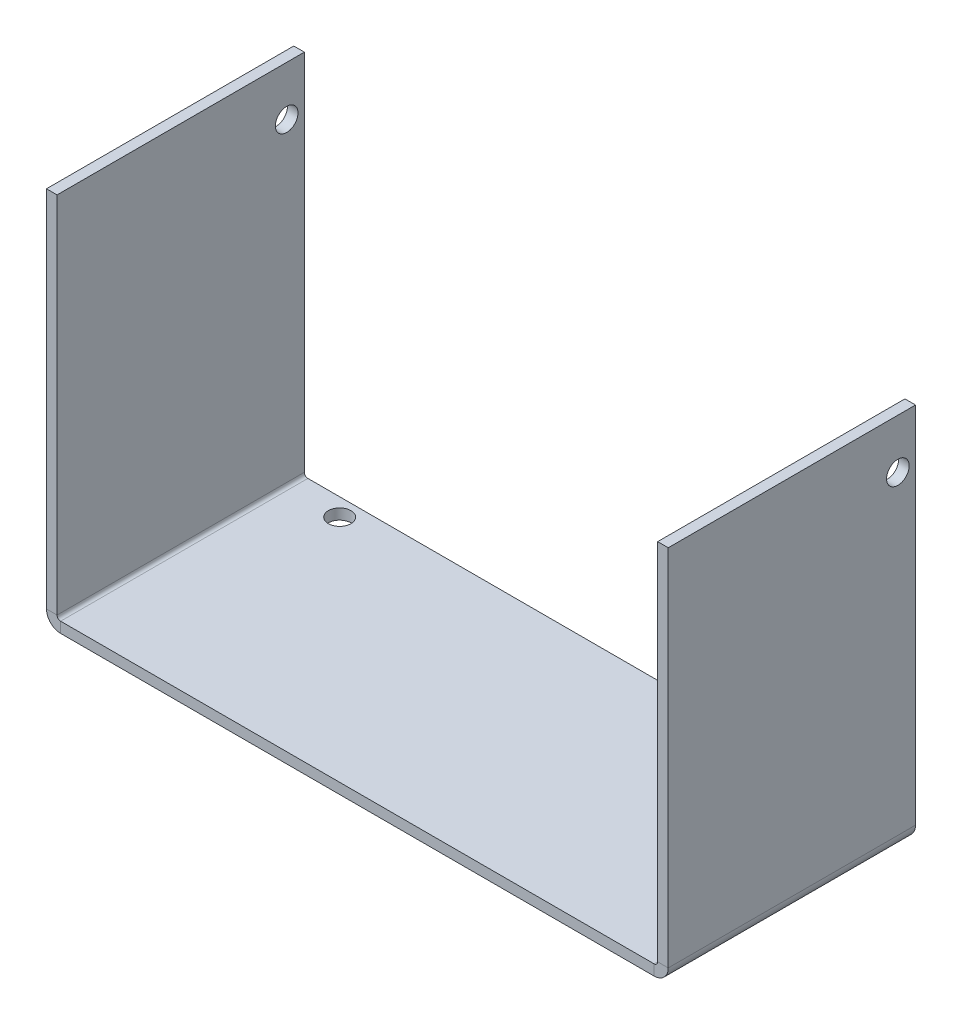
ISO-10303-21;
HEADER;
FILE_DESCRIPTION(('STEP AP214'),'2;1');
FILE_NAME('part.step','',(''),(''),'','','');
FILE_SCHEMA(('AUTOMOTIVE_DESIGN { 1 0 10303 214 1 1 1 1 }'));
ENDSEC;
DATA;
#1=APPLICATION_CONTEXT('core data for automotive mechanical design processes');
#2=APPLICATION_PROTOCOL_DEFINITION('international standard','automotive_design',2000,#1);
#3=PRODUCT_CONTEXT('',#1,'mechanical');
#4=PRODUCT('Part','Part','',(#3));
#5=PRODUCT_RELATED_PRODUCT_CATEGORY('part','',(#4));
#6=PRODUCT_DEFINITION_FORMATION('','',#4);
#7=PRODUCT_DEFINITION_CONTEXT('part definition',#1,'design');
#8=PRODUCT_DEFINITION('design','',#6,#7);
#9=PRODUCT_DEFINITION_SHAPE('','',#8);
#10=(LENGTH_UNIT() NAMED_UNIT(*) SI_UNIT(.MILLI.,.METRE.));
#11=(NAMED_UNIT(*) PLANE_ANGLE_UNIT() SI_UNIT($,.RADIAN.));
#12=(NAMED_UNIT(*) SI_UNIT($,.STERADIAN.) SOLID_ANGLE_UNIT());
#13=UNCERTAINTY_MEASURE_WITH_UNIT(LENGTH_MEASURE(1.E-05),#10,'distance_accuracy_value','');
#14=(GEOMETRIC_REPRESENTATION_CONTEXT(3) GLOBAL_UNCERTAINTY_ASSIGNED_CONTEXT((#13)) GLOBAL_UNIT_ASSIGNED_CONTEXT((#10,
#11,#12)) REPRESENTATION_CONTEXT('',''));
#15=CARTESIAN_POINT('',(0.,0.,0.));
#16=DIRECTION('',(0.,0.,1.));
#17=DIRECTION('',(1.,0.,0.));
#18=AXIS2_PLACEMENT_3D('',#15,#16,#17);
#19=CARTESIAN_POINT('',(-42.,2.,35.));
#20=DIRECTION('',(0.,0.,-1.));
#21=DIRECTION('',(-1.,0.,0.));
#22=AXIS2_PLACEMENT_3D('',#19,#20,#21);
#23=PLANE('',#22);
#24=DIRECTION('',(0.,-1.,0.));
#25=VECTOR('',#24,1.);
#26=CARTESIAN_POINT('',(-42.,0.,35.));
#27=LINE('',#26,#25);
#28=CARTESIAN_POINT('',(-42.,1.5,35.));
#29=VERTEX_POINT('',#28);
#30=CARTESIAN_POINT('',(-42.,0.,35.));
#31=VERTEX_POINT('',#30);
#32=EDGE_CURVE('E11',#29,#31,#27,.T.);
#33=ORIENTED_EDGE('',*,*,#32,.F.);
#34=CARTESIAN_POINT('',(-42.,2.,35.));
#35=DIRECTION('',(0.,0.,-1.));
#36=DIRECTION('',(-1.,0.,0.));
#37=AXIS2_PLACEMENT_3D('',#34,#35,#36);
#38=CIRCLE('',#37,0.5);
#39=CARTESIAN_POINT('',(-42.5,2.,35.));
#40=VERTEX_POINT('',#39);
#41=EDGE_CURVE('E104',#40,#29,#38,.F.);
#42=ORIENTED_EDGE('',*,*,#41,.F.);
#43=DIRECTION('',(-1.,0.,0.));
#44=VECTOR('',#43,1.);
#45=CARTESIAN_POINT('',(-44.,2.,35.));
#46=LINE('',#45,#44);
#47=CARTESIAN_POINT('',(-44.,2.,35.));
#48=VERTEX_POINT('',#47);
#49=EDGE_CURVE('E52',#40,#48,#46,.T.);
#50=ORIENTED_EDGE('',*,*,#49,.T.);
#51=CARTESIAN_POINT('',(-42.,2.,35.));
#52=DIRECTION('',(0.,0.,1.));
#53=DIRECTION('',(1.,0.,0.));
#54=AXIS2_PLACEMENT_3D('',#51,#52,#53);
#55=CIRCLE('',#54,2.);
#56=EDGE_CURVE('E107',#48,#31,#55,.T.);
#57=ORIENTED_EDGE('',*,*,#56,.T.);
#58=EDGE_LOOP('',(#33,#42,#50,#57));
#59=FACE_BOUND('',#58,.T.);
#60=ADVANCED_FACE('F42',(#59),#23,.F.);
#61=CARTESIAN_POINT('',(-44.,53.5,35.));
#62=DIRECTION('',(0.,0.,1.));
#63=DIRECTION('',(0.,-1.,0.));
#64=AXIS2_PLACEMENT_3D('',#61,#62,#63);
#65=PLANE('',#64);
#66=ORIENTED_EDGE('',*,*,#49,.F.);
#67=DIRECTION('',(0.,1.,0.));
#68=VECTOR('',#67,1.);
#69=CARTESIAN_POINT('',(-42.5,53.5,35.));
#70=LINE('',#69,#68);
#71=CARTESIAN_POINT('',(-42.5,53.5,35.));
#72=VERTEX_POINT('',#71);
#73=EDGE_CURVE('E259',#72,#40,#70,.F.);
#74=ORIENTED_EDGE('',*,*,#73,.F.);
#75=DIRECTION('',(-1.,0.,0.));
#76=VECTOR('',#75,1.);
#77=CARTESIAN_POINT('',(-44.,53.5,35.));
#78=LINE('',#77,#76);
#79=CARTESIAN_POINT('',(-44.,53.5,35.));
#80=VERTEX_POINT('',#79);
#81=EDGE_CURVE('E179',#72,#80,#78,.T.);
#82=ORIENTED_EDGE('',*,*,#81,.T.);
#83=DIRECTION('',(0.,-1.,0.));
#84=VECTOR('',#83,1.);
#85=CARTESIAN_POINT('',(-44.,53.5,35.));
#86=LINE('',#85,#84);
#87=EDGE_CURVE('E200',#80,#48,#86,.T.);
#88=ORIENTED_EDGE('',*,*,#87,.T.);
#89=EDGE_LOOP('',(#66,#74,#82,#88));
#90=FACE_BOUND('',#89,.T.);
#91=ADVANCED_FACE('F201',(#90),#65,.T.);
#92=CARTESIAN_POINT('',(-44.,53.5,35.));
#93=DIRECTION('',(0.,-1.,0.));
#94=DIRECTION('',(0.,0.,-1.));
#95=AXIS2_PLACEMENT_3D('',#92,#93,#94);
#96=PLANE('',#95);
#97=ORIENTED_EDGE('',*,*,#81,.F.);
#98=DIRECTION('',(0.,0.,1.));
#99=VECTOR('',#98,1.);
#100=CARTESIAN_POINT('',(-42.5,53.5,35.));
#101=LINE('',#100,#99);
#102=CARTESIAN_POINT('',(-42.5,53.5,0.));
#103=VERTEX_POINT('',#102);
#104=EDGE_CURVE('E152',#72,#103,#101,.F.);
#105=ORIENTED_EDGE('',*,*,#104,.T.);
#106=DIRECTION('',(-1.,0.,0.));
#107=VECTOR('',#106,1.);
#108=CARTESIAN_POINT('',(-44.,53.5,0.));
#109=LINE('',#108,#107);
#110=CARTESIAN_POINT('',(-44.,53.5,0.));
#111=VERTEX_POINT('',#110);
#112=EDGE_CURVE('E176',#103,#111,#109,.T.);
#113=ORIENTED_EDGE('',*,*,#112,.T.);
#114=DIRECTION('',(0.,0.,-1.));
#115=VECTOR('',#114,1.);
#116=CARTESIAN_POINT('',(-44.,53.5,35.));
#117=LINE('',#116,#115);
#118=EDGE_CURVE('E205',#80,#111,#117,.T.);
#119=ORIENTED_EDGE('',*,*,#118,.F.);
#120=EDGE_LOOP('',(#97,#105,#113,#119));
#121=FACE_BOUND('',#120,.T.);
#122=ADVANCED_FACE('F283',(#121),#96,.F.);
#123=CARTESIAN_POINT('',(-44.,53.5,0.));
#124=DIRECTION('',(0.,0.,1.));
#125=DIRECTION('',(0.,-1.,0.));
#126=AXIS2_PLACEMENT_3D('',#123,#124,#125);
#127=PLANE('',#126);
#128=ORIENTED_EDGE('',*,*,#112,.F.);
#129=DIRECTION('',(0.,1.,0.));
#130=VECTOR('',#129,1.);
#131=CARTESIAN_POINT('',(-42.5,53.5,0.));
#132=LINE('',#131,#130);
#133=CARTESIAN_POINT('',(-42.5,2.,0.));
#134=VERTEX_POINT('',#133);
#135=EDGE_CURVE('E157',#103,#134,#132,.F.);
#136=ORIENTED_EDGE('',*,*,#135,.T.);
#137=DIRECTION('',(-1.,0.,0.));
#138=VECTOR('',#137,1.);
#139=CARTESIAN_POINT('',(-44.,2.,0.));
#140=LINE('',#139,#138);
#141=CARTESIAN_POINT('',(-44.,2.,0.));
#142=VERTEX_POINT('',#141);
#143=EDGE_CURVE('E173',#134,#142,#140,.T.);
#144=ORIENTED_EDGE('',*,*,#143,.T.);
#145=DIRECTION('',(0.,-1.,0.));
#146=VECTOR('',#145,1.);
#147=CARTESIAN_POINT('',(-44.,53.5,0.));
#148=LINE('',#147,#146);
#149=EDGE_CURVE('E210',#111,#142,#148,.T.);
#150=ORIENTED_EDGE('',*,*,#149,.F.);
#151=EDGE_LOOP('',(#128,#136,#144,#150));
#152=FACE_BOUND('',#151,.T.);
#153=ADVANCED_FACE('F288',(#152),#127,.F.);
#154=CARTESIAN_POINT('',(-42.,2.,0.));
#155=DIRECTION('',(0.,0.,-1.));
#156=DIRECTION('',(-1.,0.,0.));
#157=AXIS2_PLACEMENT_3D('',#154,#155,#156);
#158=PLANE('',#157);
#159=ORIENTED_EDGE('',*,*,#143,.F.);
#160=CARTESIAN_POINT('',(-42.,2.,0.));
#161=DIRECTION('',(0.,0.,-1.));
#162=DIRECTION('',(-1.,0.,0.));
#163=AXIS2_PLACEMENT_3D('',#160,#161,#162);
#164=CIRCLE('',#163,0.5);
#165=CARTESIAN_POINT('',(-42.,1.5,0.));
#166=VERTEX_POINT('',#165);
#167=EDGE_CURVE('E133',#166,#134,#164,.T.);
#168=ORIENTED_EDGE('',*,*,#167,.F.);
#169=DIRECTION('',(0.,-1.,0.));
#170=VECTOR('',#169,1.);
#171=CARTESIAN_POINT('',(-42.,0.,0.));
#172=LINE('',#171,#170);
#173=CARTESIAN_POINT('',(-42.,0.,0.));
#174=VERTEX_POINT('',#173);
#175=EDGE_CURVE('E170',#166,#174,#172,.T.);
#176=ORIENTED_EDGE('',*,*,#175,.T.);
#177=CARTESIAN_POINT('',(-42.,2.,0.));
#178=DIRECTION('',(0.,0.,1.));
#179=DIRECTION('',(1.,0.,0.));
#180=AXIS2_PLACEMENT_3D('',#177,#178,#179);
#181=CIRCLE('',#180,2.);
#182=EDGE_CURVE('E196',#174,#142,#181,.F.);
#183=ORIENTED_EDGE('',*,*,#182,.T.);
#184=EDGE_LOOP('',(#159,#168,#176,#183));
#185=FACE_BOUND('',#184,.T.);
#186=ADVANCED_FACE('F291',(#185),#158,.T.);
#187=CARTESIAN_POINT('',(-44.,0.,0.));
#188=DIRECTION('',(0.,0.,1.));
#189=DIRECTION('',(1.,0.,0.));
#190=AXIS2_PLACEMENT_3D('',#187,#188,#189);
#191=PLANE('',#190);
#192=ORIENTED_EDGE('',*,*,#175,.F.);
#193=DIRECTION('',(-1.,0.,0.));
#194=VECTOR('',#193,1.);
#195=CARTESIAN_POINT('',(-44.,1.5,0.));
#196=LINE('',#195,#194);
#197=CARTESIAN_POINT('',(42.,1.50000000000002,0.));
#198=VERTEX_POINT('',#197);
#199=EDGE_CURVE('E123',#166,#198,#196,.F.);
#200=ORIENTED_EDGE('',*,*,#199,.T.);
#201=DIRECTION('',(0.,-1.,0.));
#202=VECTOR('',#201,1.);
#203=CARTESIAN_POINT('',(42.,0.,0.));
#204=LINE('',#203,#202);
#205=CARTESIAN_POINT('',(42.,0.,0.));
#206=VERTEX_POINT('',#205);
#207=EDGE_CURVE('E167',#198,#206,#204,.T.);
#208=ORIENTED_EDGE('',*,*,#207,.T.);
#209=DIRECTION('',(1.,0.,0.));
#210=VECTOR('',#209,1.);
#211=CARTESIAN_POINT('',(-44.,0.,0.));
#212=LINE('',#211,#210);
#213=EDGE_CURVE('E227',#174,#206,#212,.T.);
#214=ORIENTED_EDGE('',*,*,#213,.F.);
#215=EDGE_LOOP('',(#192,#200,#208,#214));
#216=FACE_BOUND('',#215,.T.);
#217=ADVANCED_FACE('F297',(#216),#191,.F.);
#218=CARTESIAN_POINT('',(42.,2.00000000000002,0.));
#219=DIRECTION('',(0.,0.,-1.));
#220=DIRECTION('',(-1.,0.,0.));
#221=AXIS2_PLACEMENT_3D('',#218,#219,#220);
#222=PLANE('',#221);
#223=ORIENTED_EDGE('',*,*,#207,.F.);
#224=CARTESIAN_POINT('',(42.,2.00000000000002,0.));
#225=DIRECTION('',(0.,0.,-1.));
#226=DIRECTION('',(-1.,0.,0.));
#227=AXIS2_PLACEMENT_3D('',#224,#225,#226);
#228=CIRCLE('',#227,0.5);
#229=CARTESIAN_POINT('',(42.5,2.00000000000002,0.));
#230=VERTEX_POINT('',#229);
#231=EDGE_CURVE('E263',#230,#198,#228,.T.);
#232=ORIENTED_EDGE('',*,*,#231,.F.);
#233=DIRECTION('',(1.,0.,0.));
#234=VECTOR('',#233,1.);
#235=CARTESIAN_POINT('',(44.,2.00000000000002,0.));
#236=LINE('',#235,#234);
#237=CARTESIAN_POINT('',(44.,2.00000000000002,0.));
#238=VERTEX_POINT('',#237);
#239=EDGE_CURVE('E164',#230,#238,#236,.T.);
#240=ORIENTED_EDGE('',*,*,#239,.T.);
#241=CARTESIAN_POINT('',(42.,2.00000000000002,0.));
#242=DIRECTION('',(0.,0.,1.));
#243=DIRECTION('',(1.,0.,0.));
#244=AXIS2_PLACEMENT_3D('',#241,#242,#243);
#245=CIRCLE('',#244,2.);
#246=EDGE_CURVE('E250',#238,#206,#245,.F.);
#247=ORIENTED_EDGE('',*,*,#246,.T.);
#248=EDGE_LOOP('',(#223,#232,#240,#247));
#249=FACE_BOUND('',#248,.T.);
#250=ADVANCED_FACE('F312',(#249),#222,.T.);
#251=CARTESIAN_POINT('',(44.,0.,0.));
#252=DIRECTION('',(0.,0.,1.));
#253=DIRECTION('',(0.,1.,0.));
#254=AXIS2_PLACEMENT_3D('',#251,#252,#253);
#255=PLANE('',#254);
#256=ORIENTED_EDGE('',*,*,#239,.F.);
#257=DIRECTION('',(0.,-1.,0.));
#258=VECTOR('',#257,1.);
#259=CARTESIAN_POINT('',(42.5,0.,0.));
#260=LINE('',#259,#258);
#261=CARTESIAN_POINT('',(42.5,53.5,0.));
#262=VERTEX_POINT('',#261);
#263=EDGE_CURVE('E256',#230,#262,#260,.F.);
#264=ORIENTED_EDGE('',*,*,#263,.T.);
#265=DIRECTION('',(1.,0.,0.));
#266=VECTOR('',#265,1.);
#267=CARTESIAN_POINT('',(44.,53.5,0.));
#268=LINE('',#267,#266);
#269=CARTESIAN_POINT('',(44.,53.5,0.));
#270=VERTEX_POINT('',#269);
#271=EDGE_CURVE('E162',#262,#270,#268,.T.);
#272=ORIENTED_EDGE('',*,*,#271,.T.);
#273=DIRECTION('',(0.,1.,0.));
#274=VECTOR('',#273,1.);
#275=CARTESIAN_POINT('',(44.,0.,0.));
#276=LINE('',#275,#274);
#277=EDGE_CURVE('E242',#238,#270,#276,.T.);
#278=ORIENTED_EDGE('',*,*,#277,.F.);
#279=EDGE_LOOP('',(#256,#264,#272,#278));
#280=FACE_BOUND('',#279,.T.);
#281=ADVANCED_FACE('F315',(#280),#255,.F.);
#282=CARTESIAN_POINT('',(44.,53.5,35.));
#283=DIRECTION('',(0.,1.,0.));
#284=DIRECTION('',(0.,0.,-1.));
#285=AXIS2_PLACEMENT_3D('',#282,#283,#284);
#286=PLANE('',#285);
#287=ORIENTED_EDGE('',*,*,#271,.F.);
#288=DIRECTION('',(0.,0.,1.));
#289=VECTOR('',#288,1.);
#290=CARTESIAN_POINT('',(42.5,53.5,35.));
#291=LINE('',#290,#289);
#292=CARTESIAN_POINT('',(42.5,53.5,35.));
#293=VERTEX_POINT('',#292);
#294=EDGE_CURVE('E264',#293,#262,#291,.F.);
#295=ORIENTED_EDGE('',*,*,#294,.F.);
#296=DIRECTION('',(1.,0.,0.));
#297=VECTOR('',#296,1.);
#298=CARTESIAN_POINT('',(44.,53.5,35.));
#299=LINE('',#298,#297);
#300=CARTESIAN_POINT('',(44.,53.5,35.));
#301=VERTEX_POINT('',#300);
#302=EDGE_CURVE('E60',#293,#301,#299,.T.);
#303=ORIENTED_EDGE('',*,*,#302,.T.);
#304=DIRECTION('',(0.,0.,-1.));
#305=VECTOR('',#304,1.);
#306=CARTESIAN_POINT('',(44.,53.5,35.));
#307=LINE('',#306,#305);
#308=EDGE_CURVE('E245',#301,#270,#307,.T.);
#309=ORIENTED_EDGE('',*,*,#308,.T.);
#310=EDGE_LOOP('',(#287,#295,#303,#309));
#311=FACE_BOUND('',#310,.T.);
#312=ADVANCED_FACE('F333',(#311),#286,.T.);
#313=CARTESIAN_POINT('',(44.,0.,35.));
#314=DIRECTION('',(0.,0.,1.));
#315=DIRECTION('',(0.,1.,0.));
#316=AXIS2_PLACEMENT_3D('',#313,#314,#315);
#317=PLANE('',#316);
#318=ORIENTED_EDGE('',*,*,#302,.F.);
#319=DIRECTION('',(0.,-1.,0.));
#320=VECTOR('',#319,1.);
#321=CARTESIAN_POINT('',(42.5,0.,35.));
#322=LINE('',#321,#320);
#323=CARTESIAN_POINT('',(42.5,2.00000000000002,35.));
#324=VERTEX_POINT('',#323);
#325=EDGE_CURVE('E150',#324,#293,#322,.F.);
#326=ORIENTED_EDGE('',*,*,#325,.F.);
#327=DIRECTION('',(1.,0.,0.));
#328=VECTOR('',#327,1.);
#329=CARTESIAN_POINT('',(44.,2.00000000000002,35.));
#330=LINE('',#329,#328);
#331=CARTESIAN_POINT('',(44.,2.00000000000002,35.));
#332=VERTEX_POINT('',#331);
#333=EDGE_CURVE('E158',#324,#332,#330,.T.);
#334=ORIENTED_EDGE('',*,*,#333,.T.);
#335=DIRECTION('',(0.,1.,0.));
#336=VECTOR('',#335,1.);
#337=CARTESIAN_POINT('',(44.,0.,35.));
#338=LINE('',#337,#336);
#339=EDGE_CURVE('E236',#332,#301,#338,.T.);
#340=ORIENTED_EDGE('',*,*,#339,.T.);
#341=EDGE_LOOP('',(#318,#326,#334,#340));
#342=FACE_BOUND('',#341,.T.);
#343=ADVANCED_FACE('F331',(#342),#317,.T.);
#344=CARTESIAN_POINT('',(42.,2.00000000000002,35.));
#345=DIRECTION('',(0.,0.,-1.));
#346=DIRECTION('',(-1.,0.,0.));
#347=AXIS2_PLACEMENT_3D('',#344,#345,#346);
#348=PLANE('',#347);
#349=ORIENTED_EDGE('',*,*,#333,.F.);
#350=CARTESIAN_POINT('',(42.,2.00000000000002,35.));
#351=DIRECTION('',(0.,0.,-1.));
#352=DIRECTION('',(-1.,0.,0.));
#353=AXIS2_PLACEMENT_3D('',#350,#351,#352);
#354=CIRCLE('',#353,0.5);
#355=CARTESIAN_POINT('',(42.,1.50000000000002,35.));
#356=VERTEX_POINT('',#355);
#357=EDGE_CURVE('E260',#356,#324,#354,.F.);
#358=ORIENTED_EDGE('',*,*,#357,.F.);
#359=DIRECTION('',(0.,-1.,0.));
#360=VECTOR('',#359,1.);
#361=CARTESIAN_POINT('',(42.,0.,35.));
#362=LINE('',#361,#360);
#363=CARTESIAN_POINT('',(42.,0.,35.));
#364=VERTEX_POINT('',#363);
#365=EDGE_CURVE('E46',#356,#364,#362,.T.);
#366=ORIENTED_EDGE('',*,*,#365,.T.);
#367=CARTESIAN_POINT('',(42.,2.00000000000002,35.));
#368=DIRECTION('',(0.,0.,1.));
#369=DIRECTION('',(1.,0.,0.));
#370=AXIS2_PLACEMENT_3D('',#367,#368,#369);
#371=CIRCLE('',#370,2.);
#372=EDGE_CURVE('E247',#364,#332,#371,.T.);
#373=ORIENTED_EDGE('',*,*,#372,.T.);
#374=EDGE_LOOP('',(#349,#358,#366,#373));
#375=FACE_BOUND('',#374,.T.);
#376=ADVANCED_FACE('F323',(#375),#348,.F.);
#377=CARTESIAN_POINT('',(-44.,46.4999999999999,2.5));
#378=DIRECTION('',(1.,0.,0.));
#379=DIRECTION('',(0.,1.,0.));
#380=AXIS2_PLACEMENT_3D('',#377,#378,#379);
#381=CYLINDRICAL_SURFACE('',#380,1.6);
#382=CARTESIAN_POINT('',(-44.,46.4999999999999,2.5));
#383=DIRECTION('',(1.,0.,0.));
#384=DIRECTION('',(0.,1.,0.));
#385=AXIS2_PLACEMENT_3D('',#382,#383,#384);
#386=CIRCLE('',#385,1.6);
#387=CARTESIAN_POINT('',(-44.,48.0999999999999,2.5));
#388=VERTEX_POINT('',#387);
#389=EDGE_CURVE('E213',#388,#388,#386,.T.);
#390=ORIENTED_EDGE('',*,*,#389,.F.);
#391=EDGE_LOOP('',(#390));
#392=FACE_BOUND('',#391,.T.);
#393=CARTESIAN_POINT('',(-42.5,46.4999999999999,2.5));
#394=DIRECTION('',(1.,0.,0.));
#395=DIRECTION('',(0.,1.,0.));
#396=AXIS2_PLACEMENT_3D('',#393,#394,#395);
#397=CIRCLE('',#396,1.6);
#398=CARTESIAN_POINT('',(-42.5,48.0999999999999,2.5));
#399=VERTEX_POINT('',#398);
#400=EDGE_CURVE('E154',#399,#399,#397,.T.);
#401=ORIENTED_EDGE('',*,*,#400,.T.);
#402=EDGE_LOOP('',(#401));
#403=FACE_BOUND('',#402,.T.);
#404=ADVANCED_FACE('F44',(#392,#403),#381,.F.);
#405=CARTESIAN_POINT('',(-35.,0.,2.5));
#406=DIRECTION('',(0.,1.,0.));
#407=DIRECTION('',(-1.,0.,0.));
#408=AXIS2_PLACEMENT_3D('',#405,#406,#407);
#409=CYLINDRICAL_SURFACE('',#408,1.60000000000001);
#410=CARTESIAN_POINT('',(-35.,0.,2.5));
#411=DIRECTION('',(0.,-1.,0.));
#412=DIRECTION('',(0.,0.,-1.));
#413=AXIS2_PLACEMENT_3D('',#410,#411,#412);
#414=CIRCLE('',#413,1.60000000000001);
#415=CARTESIAN_POINT('',(-35.,0.,0.899999999999995));
#416=VERTEX_POINT('',#415);
#417=EDGE_CURVE('E218',#416,#416,#414,.T.);
#418=ORIENTED_EDGE('',*,*,#417,.T.);
#419=EDGE_LOOP('',(#418));
#420=FACE_BOUND('',#419,.T.);
#421=CARTESIAN_POINT('',(-35.,1.5,2.5));
#422=DIRECTION('',(0.,-1.,0.));
#423=DIRECTION('',(0.,0.,-1.));
#424=AXIS2_PLACEMENT_3D('',#421,#422,#423);
#425=CIRCLE('',#424,1.60000000000001);
#426=CARTESIAN_POINT('',(-35.,1.5,0.899999999999995));
#427=VERTEX_POINT('',#426);
#428=EDGE_CURVE('E143',#427,#427,#425,.T.);
#429=ORIENTED_EDGE('',*,*,#428,.F.);
#430=EDGE_LOOP('',(#429));
#431=FACE_BOUND('',#430,.T.);
#432=ADVANCED_FACE('F357',(#420,#431),#409,.F.);
#433=CARTESIAN_POINT('',(35.,0.,2.5));
#434=DIRECTION('',(0.,1.,0.));
#435=DIRECTION('',(-1.,0.,0.));
#436=AXIS2_PLACEMENT_3D('',#433,#434,#435);
#437=CYLINDRICAL_SURFACE('',#436,1.60000000000001);
#438=CARTESIAN_POINT('',(35.,0.,2.5));
#439=DIRECTION('',(0.,-1.,0.));
#440=DIRECTION('',(0.,0.,-1.));
#441=AXIS2_PLACEMENT_3D('',#438,#439,#440);
#442=CIRCLE('',#441,1.60000000000001);
#443=CARTESIAN_POINT('',(35.,0.,0.899999999999995));
#444=VERTEX_POINT('',#443);
#445=EDGE_CURVE('E221',#444,#444,#442,.T.);
#446=ORIENTED_EDGE('',*,*,#445,.T.);
#447=EDGE_LOOP('',(#446));
#448=FACE_BOUND('',#447,.T.);
#449=CARTESIAN_POINT('',(35.,1.5,2.5));
#450=DIRECTION('',(0.,-1.,0.));
#451=DIRECTION('',(0.,0.,-1.));
#452=AXIS2_PLACEMENT_3D('',#449,#450,#451);
#453=CIRCLE('',#452,1.60000000000001);
#454=CARTESIAN_POINT('',(35.,1.5,0.899999999999995));
#455=VERTEX_POINT('',#454);
#456=EDGE_CURVE('E140',#455,#455,#453,.T.);
#457=ORIENTED_EDGE('',*,*,#456,.F.);
#458=EDGE_LOOP('',(#457));
#459=FACE_BOUND('',#458,.T.);
#460=ADVANCED_FACE('F355',(#448,#459),#437,.F.);
#461=CARTESIAN_POINT('',(44.,46.5,2.5));
#462=DIRECTION('',(-1.,0.,0.));
#463=DIRECTION('',(0.,-1.,0.));
#464=AXIS2_PLACEMENT_3D('',#461,#462,#463);
#465=CYLINDRICAL_SURFACE('',#464,1.6);
#466=CARTESIAN_POINT('',(44.,46.5,2.5));
#467=DIRECTION('',(1.,0.,0.));
#468=DIRECTION('',(0.,1.,0.));
#469=AXIS2_PLACEMENT_3D('',#466,#467,#468);
#470=CIRCLE('',#469,1.6);
#471=CARTESIAN_POINT('',(44.,48.1,2.5));
#472=VERTEX_POINT('',#471);
#473=EDGE_CURVE('E233',#472,#472,#470,.T.);
#474=ORIENTED_EDGE('',*,*,#473,.T.);
#475=EDGE_LOOP('',(#474));
#476=FACE_BOUND('',#475,.T.);
#477=CARTESIAN_POINT('',(42.5,46.5,2.5));
#478=DIRECTION('',(1.,0.,0.));
#479=DIRECTION('',(0.,1.,0.));
#480=AXIS2_PLACEMENT_3D('',#477,#478,#479);
#481=CIRCLE('',#480,1.6);
#482=CARTESIAN_POINT('',(42.5,48.1,2.5));
#483=VERTEX_POINT('',#482);
#484=EDGE_CURVE('E147',#483,#483,#481,.T.);
#485=ORIENTED_EDGE('',*,*,#484,.F.);
#486=EDGE_LOOP('',(#485));
#487=FACE_BOUND('',#486,.T.);
#488=ADVANCED_FACE('F352',(#476,#487),#465,.F.);
#489=CARTESIAN_POINT('',(-44.,0.,35.));
#490=DIRECTION('',(0.,0.,1.));
#491=DIRECTION('',(1.,0.,0.));
#492=AXIS2_PLACEMENT_3D('',#489,#490,#491);
#493=PLANE('',#492);
#494=DIRECTION('',(-1.,0.,0.));
#495=VECTOR('',#494,1.);
#496=CARTESIAN_POINT('',(-44.,1.5,35.));
#497=LINE('',#496,#495);
#498=EDGE_CURVE('E120',#29,#356,#497,.F.);
#499=ORIENTED_EDGE('',*,*,#498,.F.);
#500=ORIENTED_EDGE('',*,*,#32,.T.);
#501=DIRECTION('',(1.,0.,0.));
#502=VECTOR('',#501,1.);
#503=CARTESIAN_POINT('',(-44.,0.,35.));
#504=LINE('',#503,#502);
#505=EDGE_CURVE('E224',#31,#364,#504,.T.);
#506=ORIENTED_EDGE('',*,*,#505,.T.);
#507=ORIENTED_EDGE('',*,*,#365,.F.);
#508=EDGE_LOOP('',(#499,#500,#506,#507));
#509=FACE_BOUND('',#508,.T.);
#510=ADVANCED_FACE('F137',(#509),#493,.T.);
#511=CARTESIAN_POINT('',(42.,2.00000000000002,35.));
#512=DIRECTION('',(0.,0.,-1.));
#513=DIRECTION('',(-1.,0.,0.));
#514=AXIS2_PLACEMENT_3D('',#511,#512,#513);
#515=CYLINDRICAL_SURFACE('',#514,2.);
#516=ORIENTED_EDGE('',*,*,#372,.F.);
#517=DIRECTION('',(0.,0.,-1.));
#518=VECTOR('',#517,1.);
#519=CARTESIAN_POINT('',(42.,0.,35.));
#520=LINE('',#519,#518);
#521=EDGE_CURVE('E197',#206,#364,#520,.F.);
#522=ORIENTED_EDGE('',*,*,#521,.F.);
#523=ORIENTED_EDGE('',*,*,#246,.F.);
#524=DIRECTION('',(0.,0.,-1.));
#525=VECTOR('',#524,1.);
#526=CARTESIAN_POINT('',(44.,2.00000000000002,35.));
#527=LINE('',#526,#525);
#528=EDGE_CURVE('E239',#332,#238,#527,.T.);
#529=ORIENTED_EDGE('',*,*,#528,.F.);
#530=EDGE_LOOP('',(#516,#522,#523,#529));
#531=FACE_BOUND('',#530,.T.);
#532=ADVANCED_FACE('F319',(#531),#515,.T.);
#533=CARTESIAN_POINT('',(44.,0.,35.));
#534=DIRECTION('',(-1.,0.,0.));
#535=DIRECTION('',(0.,-1.,0.));
#536=AXIS2_PLACEMENT_3D('',#533,#534,#535);
#537=PLANE('',#536);
#538=ORIENTED_EDGE('',*,*,#473,.F.);
#539=EDGE_LOOP('',(#538));
#540=FACE_BOUND('',#539,.T.);
#541=ORIENTED_EDGE('',*,*,#339,.F.);
#542=ORIENTED_EDGE('',*,*,#528,.T.);
#543=ORIENTED_EDGE('',*,*,#277,.T.);
#544=ORIENTED_EDGE('',*,*,#308,.F.);
#545=EDGE_LOOP('',(#541,#542,#543,#544));
#546=FACE_BOUND('',#545,.T.);
#547=ADVANCED_FACE('F321',(#540,#546),#537,.F.);
#548=CARTESIAN_POINT('',(-42.,2.,35.));
#549=DIRECTION('',(0.,0.,-1.));
#550=DIRECTION('',(-1.,0.,0.));
#551=AXIS2_PLACEMENT_3D('',#548,#549,#550);
#552=CYLINDRICAL_SURFACE('',#551,2.);
#553=ORIENTED_EDGE('',*,*,#56,.F.);
#554=DIRECTION('',(0.,0.,-1.));
#555=VECTOR('',#554,1.);
#556=CARTESIAN_POINT('',(-44.,2.,35.));
#557=LINE('',#556,#555);
#558=EDGE_CURVE('E193',#142,#48,#557,.F.);
#559=ORIENTED_EDGE('',*,*,#558,.F.);
#560=ORIENTED_EDGE('',*,*,#182,.F.);
#561=DIRECTION('',(0.,0.,-1.));
#562=VECTOR('',#561,1.);
#563=CARTESIAN_POINT('',(-42.,0.,35.));
#564=LINE('',#563,#562);
#565=EDGE_CURVE('E195',#31,#174,#564,.T.);
#566=ORIENTED_EDGE('',*,*,#565,.F.);
#567=EDGE_LOOP('',(#553,#559,#560,#566));
#568=FACE_BOUND('',#567,.T.);
#569=ADVANCED_FACE('F190',(#568),#552,.T.);
#570=CARTESIAN_POINT('',(-44.,0.,35.));
#571=DIRECTION('',(0.,1.,0.));
#572=DIRECTION('',(-1.,0.,0.));
#573=AXIS2_PLACEMENT_3D('',#570,#571,#572);
#574=PLANE('',#573);
#575=ORIENTED_EDGE('',*,*,#417,.F.);
#576=EDGE_LOOP('',(#575));
#577=FACE_BOUND('',#576,.T.);
#578=ORIENTED_EDGE('',*,*,#445,.F.);
#579=EDGE_LOOP('',(#578));
#580=FACE_BOUND('',#579,.T.);
#581=ORIENTED_EDGE('',*,*,#505,.F.);
#582=ORIENTED_EDGE('',*,*,#565,.T.);
#583=ORIENTED_EDGE('',*,*,#213,.T.);
#584=ORIENTED_EDGE('',*,*,#521,.T.);
#585=EDGE_LOOP('',(#581,#582,#583,#584));
#586=FACE_BOUND('',#585,.T.);
#587=ADVANCED_FACE('F299',(#577,#580,#586),#574,.F.);
#588=CARTESIAN_POINT('',(-44.,53.5,35.));
#589=DIRECTION('',(1.,0.,0.));
#590=DIRECTION('',(0.,1.,0.));
#591=AXIS2_PLACEMENT_3D('',#588,#589,#590);
#592=PLANE('',#591);
#593=ORIENTED_EDGE('',*,*,#389,.T.);
#594=EDGE_LOOP('',(#593));
#595=FACE_BOUND('',#594,.T.);
#596=ORIENTED_EDGE('',*,*,#149,.T.);
#597=ORIENTED_EDGE('',*,*,#558,.T.);
#598=ORIENTED_EDGE('',*,*,#87,.F.);
#599=ORIENTED_EDGE('',*,*,#118,.T.);
#600=EDGE_LOOP('',(#596,#597,#598,#599));
#601=FACE_BOUND('',#600,.T.);
#602=ADVANCED_FACE('F208',(#595,#601),#592,.F.);
#603=CARTESIAN_POINT('',(42.,2.00000000000002,35.));
#604=DIRECTION('',(0.,0.,-1.));
#605=DIRECTION('',(-1.,0.,0.));
#606=AXIS2_PLACEMENT_3D('',#603,#604,#605);
#607=CYLINDRICAL_SURFACE('',#606,0.5);
#608=ORIENTED_EDGE('',*,*,#357,.T.);
#609=DIRECTION('',(0.,0.,1.));
#610=VECTOR('',#609,1.);
#611=CARTESIAN_POINT('',(42.5,2.00000000000002,35.));
#612=LINE('',#611,#610);
#613=EDGE_CURVE('E254',#324,#230,#612,.F.);
#614=ORIENTED_EDGE('',*,*,#613,.T.);
#615=ORIENTED_EDGE('',*,*,#231,.T.);
#616=DIRECTION('',(0.,0.,1.));
#617=VECTOR('',#616,1.);
#618=CARTESIAN_POINT('',(42.,1.50000000000002,35.));
#619=LINE('',#618,#617);
#620=EDGE_CURVE('E134',#198,#356,#619,.T.);
#621=ORIENTED_EDGE('',*,*,#620,.T.);
#622=EDGE_LOOP('',(#608,#614,#615,#621));
#623=FACE_BOUND('',#622,.T.);
#624=ADVANCED_FACE('F330',(#623),#607,.F.);
#625=CARTESIAN_POINT('',(42.5,0.,35.));
#626=DIRECTION('',(-1.,0.,0.));
#627=DIRECTION('',(0.,-1.,0.));
#628=AXIS2_PLACEMENT_3D('',#625,#626,#627);
#629=PLANE('',#628);
#630=ORIENTED_EDGE('',*,*,#484,.T.);
#631=EDGE_LOOP('',(#630));
#632=FACE_BOUND('',#631,.T.);
#633=ORIENTED_EDGE('',*,*,#325,.T.);
#634=ORIENTED_EDGE('',*,*,#294,.T.);
#635=ORIENTED_EDGE('',*,*,#263,.F.);
#636=ORIENTED_EDGE('',*,*,#613,.F.);
#637=EDGE_LOOP('',(#633,#634,#635,#636));
#638=FACE_BOUND('',#637,.T.);
#639=ADVANCED_FACE('F328',(#632,#638),#629,.T.);
#640=CARTESIAN_POINT('',(-42.,2.,35.));
#641=DIRECTION('',(0.,0.,-1.));
#642=DIRECTION('',(-1.,0.,0.));
#643=AXIS2_PLACEMENT_3D('',#640,#641,#642);
#644=CYLINDRICAL_SURFACE('',#643,0.5);
#645=ORIENTED_EDGE('',*,*,#41,.T.);
#646=DIRECTION('',(0.,0.,1.));
#647=VECTOR('',#646,1.);
#648=CARTESIAN_POINT('',(-42.,1.5,35.));
#649=LINE('',#648,#647);
#650=EDGE_CURVE('E117',#29,#166,#649,.F.);
#651=ORIENTED_EDGE('',*,*,#650,.T.);
#652=ORIENTED_EDGE('',*,*,#167,.T.);
#653=DIRECTION('',(0.,0.,1.));
#654=VECTOR('',#653,1.);
#655=CARTESIAN_POINT('',(-42.5,2.,35.));
#656=LINE('',#655,#654);
#657=EDGE_CURVE('E131',#134,#40,#656,.T.);
#658=ORIENTED_EDGE('',*,*,#657,.T.);
#659=EDGE_LOOP('',(#645,#651,#652,#658));
#660=FACE_BOUND('',#659,.T.);
#661=ADVANCED_FACE('F129',(#660),#644,.F.);
#662=CARTESIAN_POINT('',(-44.,1.5,35.));
#663=DIRECTION('',(0.,1.,0.));
#664=DIRECTION('',(-1.,0.,0.));
#665=AXIS2_PLACEMENT_3D('',#662,#663,#664);
#666=PLANE('',#665);
#667=ORIENTED_EDGE('',*,*,#428,.T.);
#668=EDGE_LOOP('',(#667));
#669=FACE_BOUND('',#668,.T.);
#670=ORIENTED_EDGE('',*,*,#456,.T.);
#671=EDGE_LOOP('',(#670));
#672=FACE_BOUND('',#671,.T.);
#673=ORIENTED_EDGE('',*,*,#498,.T.);
#674=ORIENTED_EDGE('',*,*,#620,.F.);
#675=ORIENTED_EDGE('',*,*,#199,.F.);
#676=ORIENTED_EDGE('',*,*,#650,.F.);
#677=EDGE_LOOP('',(#673,#674,#675,#676));
#678=FACE_BOUND('',#677,.T.);
#679=ADVANCED_FACE('F118',(#669,#672,#678),#666,.T.);
#680=CARTESIAN_POINT('',(-42.5,53.5,35.));
#681=DIRECTION('',(1.,0.,0.));
#682=DIRECTION('',(0.,1.,0.));
#683=AXIS2_PLACEMENT_3D('',#680,#681,#682);
#684=PLANE('',#683);
#685=ORIENTED_EDGE('',*,*,#400,.F.);
#686=EDGE_LOOP('',(#685));
#687=FACE_BOUND('',#686,.T.);
#688=ORIENTED_EDGE('',*,*,#135,.F.);
#689=ORIENTED_EDGE('',*,*,#104,.F.);
#690=ORIENTED_EDGE('',*,*,#73,.T.);
#691=ORIENTED_EDGE('',*,*,#657,.F.);
#692=EDGE_LOOP('',(#688,#689,#690,#691));
#693=FACE_BOUND('',#692,.T.);
#694=ADVANCED_FACE('F281',(#687,#693),#684,.T.);
#695=CLOSED_SHELL('',(#60,#91,#122,#153,#186,#217,#250,#281,#312,#343,#376,#404,#432,#460,#488,
#510,#532,#547,#569,#587,#602,#624,#639,#661,#679,#694));
#696=MANIFOLD_SOLID_BREP('B2',#695);
#697=ADVANCED_BREP_SHAPE_REPRESENTATION('',(#18,#696),#14);
#698=SHAPE_DEFINITION_REPRESENTATION(#9,#697);
ENDSEC;
END-ISO-10303-21;
